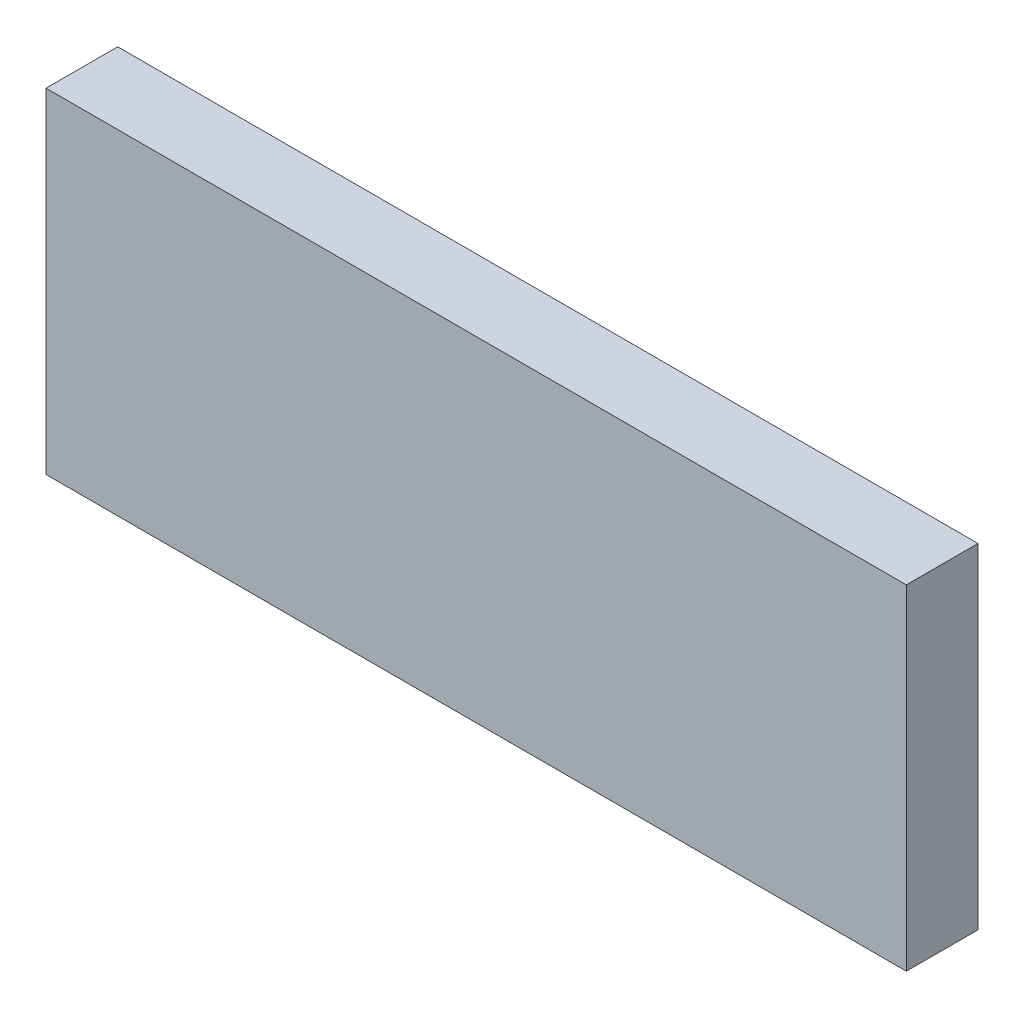
ISO-10303-21;
HEADER;
FILE_DESCRIPTION(('STEP AP214'),'2;1');
FILE_NAME('part.step','',(''),(''),'','','');
FILE_SCHEMA(('AUTOMOTIVE_DESIGN { 1 0 10303 214 1 1 1 1 }'));
ENDSEC;
DATA;
#1=APPLICATION_CONTEXT('core data for automotive mechanical design processes');
#2=APPLICATION_PROTOCOL_DEFINITION('international standard','automotive_design',2000,#1);
#3=PRODUCT_CONTEXT('',#1,'mechanical');
#4=PRODUCT('Part','Part','',(#3));
#5=PRODUCT_RELATED_PRODUCT_CATEGORY('part','',(#4));
#6=PRODUCT_DEFINITION_FORMATION('','',#4);
#7=PRODUCT_DEFINITION_CONTEXT('part definition',#1,'design');
#8=PRODUCT_DEFINITION('design','',#6,#7);
#9=PRODUCT_DEFINITION_SHAPE('','',#8);
#10=(LENGTH_UNIT() NAMED_UNIT(*) SI_UNIT(.MILLI.,.METRE.));
#11=(NAMED_UNIT(*) PLANE_ANGLE_UNIT() SI_UNIT($,.RADIAN.));
#12=(NAMED_UNIT(*) SI_UNIT($,.STERADIAN.) SOLID_ANGLE_UNIT());
#13=UNCERTAINTY_MEASURE_WITH_UNIT(LENGTH_MEASURE(1.E-05),#10,'distance_accuracy_value','');
#14=(GEOMETRIC_REPRESENTATION_CONTEXT(3) GLOBAL_UNCERTAINTY_ASSIGNED_CONTEXT((#13)) GLOBAL_UNIT_ASSIGNED_CONTEXT((#10,
#11,#12)) REPRESENTATION_CONTEXT('',''));
#15=CARTESIAN_POINT('',(0.,0.,0.));
#16=DIRECTION('',(0.,0.,1.));
#17=DIRECTION('',(1.,0.,0.));
#18=AXIS2_PLACEMENT_3D('',#15,#16,#17);
#19=CARTESIAN_POINT('',(0.,0.,0.15));
#20=DIRECTION('',(0.,0.,1.));
#21=DIRECTION('',(1.,0.,0.));
#22=AXIS2_PLACEMENT_3D('',#19,#20,#21);
#23=PLANE('',#22);
#24=DIRECTION('',(0.,1.,0.));
#25=VECTOR('',#24,1.);
#26=CARTESIAN_POINT('',(-1.95,1.15,0.15));
#27=LINE('',#26,#25);
#28=CARTESIAN_POINT('',(-1.95,1.15,0.15));
#29=VERTEX_POINT('',#28);
#30=CARTESIAN_POINT('',(-1.95,1.85,0.15));
#31=VERTEX_POINT('',#30);
#32=EDGE_CURVE('E55',#29,#31,#27,.T.);
#33=ORIENTED_EDGE('',*,*,#32,.T.);
#34=DIRECTION('',(1.,0.,0.));
#35=VECTOR('',#34,1.);
#36=CARTESIAN_POINT('',(-1.95,1.85,0.15));
#37=LINE('',#36,#35);
#38=CARTESIAN_POINT('',(-3.75,1.85,0.15));
#39=VERTEX_POINT('',#38);
#40=EDGE_CURVE('E77',#31,#39,#37,.F.);
#41=ORIENTED_EDGE('',*,*,#40,.T.);
#42=DIRECTION('',(0.,1.,0.));
#43=VECTOR('',#42,1.);
#44=CARTESIAN_POINT('',(-3.75,0.,0.15));
#45=LINE('',#44,#43);
#46=CARTESIAN_POINT('',(-3.75,1.15,0.15));
#47=VERTEX_POINT('',#46);
#48=EDGE_CURVE('E20',#39,#47,#45,.F.);
#49=ORIENTED_EDGE('',*,*,#48,.T.);
#50=DIRECTION('',(-1.,0.,0.));
#51=VECTOR('',#50,1.);
#52=CARTESIAN_POINT('',(-3.75,1.15,0.15));
#53=LINE('',#52,#51);
#54=EDGE_CURVE('E58',#47,#29,#53,.F.);
#55=ORIENTED_EDGE('',*,*,#54,.T.);
#56=EDGE_LOOP('',(#33,#41,#49,#55));
#57=FACE_BOUND('',#56,.T.);
#58=ADVANCED_FACE('F17',(#57),#23,.T.);
#59=CARTESIAN_POINT('',(-3.75,1.15,0.15));
#60=DIRECTION('',(0.,1.,0.));
#61=DIRECTION('',(-1.,0.,0.));
#62=AXIS2_PLACEMENT_3D('',#59,#60,#61);
#63=PLANE('',#62);
#64=DIRECTION('',(0.,0.,1.));
#65=VECTOR('',#64,1.);
#66=CARTESIAN_POINT('',(-1.95,1.15,0.15));
#67=LINE('',#66,#65);
#68=CARTESIAN_POINT('',(-1.95,1.15,0.));
#69=VERTEX_POINT('',#68);
#70=EDGE_CURVE('E63',#69,#29,#67,.T.);
#71=ORIENTED_EDGE('',*,*,#70,.T.);
#72=ORIENTED_EDGE('',*,*,#54,.F.);
#73=DIRECTION('',(0.,0.,1.));
#74=VECTOR('',#73,1.);
#75=CARTESIAN_POINT('',(-3.75,1.15,0.15));
#76=LINE('',#75,#74);
#77=CARTESIAN_POINT('',(-3.75,1.15,0.));
#78=VERTEX_POINT('',#77);
#79=EDGE_CURVE('E80',#47,#78,#76,.F.);
#80=ORIENTED_EDGE('',*,*,#79,.T.);
#81=DIRECTION('',(1.,0.,0.));
#82=VECTOR('',#81,1.);
#83=CARTESIAN_POINT('',(0.,1.15,0.));
#84=LINE('',#83,#82);
#85=EDGE_CURVE('E73',#78,#69,#84,.T.);
#86=ORIENTED_EDGE('',*,*,#85,.T.);
#87=EDGE_LOOP('',(#71,#72,#80,#86));
#88=FACE_BOUND('',#87,.T.);
#89=ADVANCED_FACE('F72',(#88),#63,.F.);
#90=CARTESIAN_POINT('',(-1.95,1.15,0.15));
#91=DIRECTION('',(-1.,0.,0.));
#92=DIRECTION('',(0.,0.,1.));
#93=AXIS2_PLACEMENT_3D('',#90,#91,#92);
#94=PLANE('',#93);
#95=DIRECTION('',(0.,0.,-1.));
#96=VECTOR('',#95,1.);
#97=CARTESIAN_POINT('',(-1.95,1.85,0.15));
#98=LINE('',#97,#96);
#99=CARTESIAN_POINT('',(-1.95,1.85,0.));
#100=VERTEX_POINT('',#99);
#101=EDGE_CURVE('E69',#100,#31,#98,.F.);
#102=ORIENTED_EDGE('',*,*,#101,.T.);
#103=ORIENTED_EDGE('',*,*,#32,.F.);
#104=ORIENTED_EDGE('',*,*,#70,.F.);
#105=DIRECTION('',(0.,1.,0.));
#106=VECTOR('',#105,1.);
#107=CARTESIAN_POINT('',(-1.95,0.,0.));
#108=LINE('',#107,#106);
#109=EDGE_CURVE('E83',#69,#100,#108,.T.);
#110=ORIENTED_EDGE('',*,*,#109,.T.);
#111=EDGE_LOOP('',(#102,#103,#104,#110));
#112=FACE_BOUND('',#111,.T.);
#113=ADVANCED_FACE('F66',(#112),#94,.F.);
#114=CARTESIAN_POINT('',(-1.95,1.85,0.15));
#115=DIRECTION('',(0.,-1.,0.));
#116=DIRECTION('',(0.,0.,-1.));
#117=AXIS2_PLACEMENT_3D('',#114,#115,#116);
#118=PLANE('',#117);
#119=DIRECTION('',(0.,0.,1.));
#120=VECTOR('',#119,1.);
#121=CARTESIAN_POINT('',(-3.75,1.85,0.15));
#122=LINE('',#121,#120);
#123=CARTESIAN_POINT('',(-3.75,1.85,0.));
#124=VERTEX_POINT('',#123);
#125=EDGE_CURVE('E34',#124,#39,#122,.T.);
#126=ORIENTED_EDGE('',*,*,#125,.T.);
#127=ORIENTED_EDGE('',*,*,#40,.F.);
#128=ORIENTED_EDGE('',*,*,#101,.F.);
#129=DIRECTION('',(1.,0.,0.));
#130=VECTOR('',#129,1.);
#131=CARTESIAN_POINT('',(0.,1.85,0.));
#132=LINE('',#131,#130);
#133=EDGE_CURVE('E26',#100,#124,#132,.F.);
#134=ORIENTED_EDGE('',*,*,#133,.T.);
#135=EDGE_LOOP('',(#126,#127,#128,#134));
#136=FACE_BOUND('',#135,.T.);
#137=ADVANCED_FACE('F88',(#136),#118,.F.);
#138=CARTESIAN_POINT('',(-3.75,1.85,0.15));
#139=DIRECTION('',(1.,0.,0.));
#140=DIRECTION('',(0.,1.,0.));
#141=AXIS2_PLACEMENT_3D('',#138,#139,#140);
#142=PLANE('',#141);
#143=ORIENTED_EDGE('',*,*,#79,.F.);
#144=ORIENTED_EDGE('',*,*,#48,.F.);
#145=ORIENTED_EDGE('',*,*,#125,.F.);
#146=DIRECTION('',(0.,1.,0.));
#147=VECTOR('',#146,1.);
#148=CARTESIAN_POINT('',(-3.75,0.,0.));
#149=LINE('',#148,#147);
#150=EDGE_CURVE('E11',#124,#78,#149,.F.);
#151=ORIENTED_EDGE('',*,*,#150,.T.);
#152=EDGE_LOOP('',(#143,#144,#145,#151));
#153=FACE_BOUND('',#152,.T.);
#154=ADVANCED_FACE('F91',(#153),#142,.F.);
#155=CARTESIAN_POINT('',(0.,0.,0.));
#156=DIRECTION('',(0.,0.,1.));
#157=DIRECTION('',(1.,0.,0.));
#158=AXIS2_PLACEMENT_3D('',#155,#156,#157);
#159=PLANE('',#158);
#160=ORIENTED_EDGE('',*,*,#133,.F.);
#161=ORIENTED_EDGE('',*,*,#109,.F.);
#162=ORIENTED_EDGE('',*,*,#85,.F.);
#163=ORIENTED_EDGE('',*,*,#150,.F.);
#164=EDGE_LOOP('',(#160,#161,#162,#163));
#165=FACE_BOUND('',#164,.T.);
#166=ADVANCED_FACE('F90',(#165),#159,.F.);
#167=CLOSED_SHELL('',(#58,#89,#113,#137,#154,#166));
#168=MANIFOLD_SOLID_BREP('B1',#167);
#169=ADVANCED_BREP_SHAPE_REPRESENTATION('',(#18,#168),#14);
#170=SHAPE_DEFINITION_REPRESENTATION(#9,#169);
ENDSEC;
END-ISO-10303-21;
